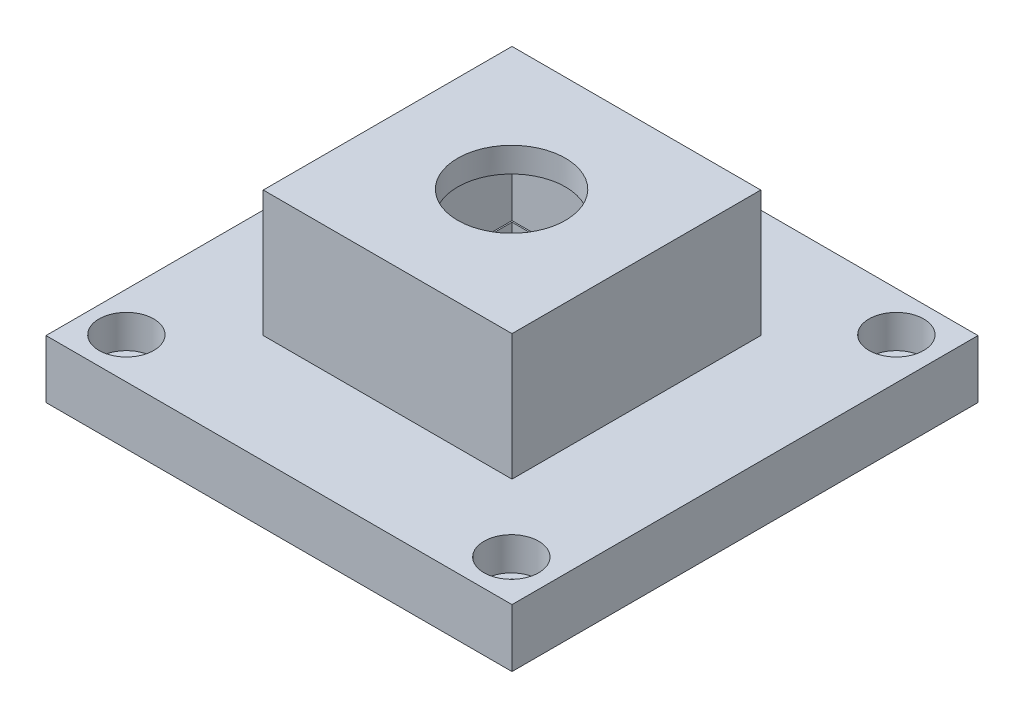
ISO-10303-21;
HEADER;
FILE_DESCRIPTION(('STEP AP214'),'2;1');
FILE_NAME('part.step','',(''),(''),'','','');
FILE_SCHEMA(('AUTOMOTIVE_DESIGN { 1 0 10303 214 1 1 1 1 }'));
ENDSEC;
DATA;
#1=APPLICATION_CONTEXT('core data for automotive mechanical design processes');
#2=APPLICATION_PROTOCOL_DEFINITION('international standard','automotive_design',2000,#1);
#3=PRODUCT_CONTEXT('',#1,'mechanical');
#4=PRODUCT('Part','Part','',(#3));
#5=PRODUCT_RELATED_PRODUCT_CATEGORY('part','',(#4));
#6=PRODUCT_DEFINITION_FORMATION('','',#4);
#7=PRODUCT_DEFINITION_CONTEXT('part definition',#1,'design');
#8=PRODUCT_DEFINITION('design','',#6,#7);
#9=PRODUCT_DEFINITION_SHAPE('','',#8);
#10=(LENGTH_UNIT() NAMED_UNIT(*) SI_UNIT(.MILLI.,.METRE.));
#11=(NAMED_UNIT(*) PLANE_ANGLE_UNIT() SI_UNIT($,.RADIAN.));
#12=(NAMED_UNIT(*) SI_UNIT($,.STERADIAN.) SOLID_ANGLE_UNIT());
#13=UNCERTAINTY_MEASURE_WITH_UNIT(LENGTH_MEASURE(1.E-05),#10,'distance_accuracy_value','');
#14=(GEOMETRIC_REPRESENTATION_CONTEXT(3) GLOBAL_UNCERTAINTY_ASSIGNED_CONTEXT((#13)) GLOBAL_UNIT_ASSIGNED_CONTEXT((#10,
#11,#12)) REPRESENTATION_CONTEXT('',''));
#15=CARTESIAN_POINT('',(0.,0.,0.));
#16=DIRECTION('',(0.,0.,1.));
#17=DIRECTION('',(1.,0.,0.));
#18=AXIS2_PLACEMENT_3D('',#15,#16,#17);
#19=CARTESIAN_POINT('',(-19.05,108.2548,0.));
#20=DIRECTION('',(-1.,0.,0.));
#21=DIRECTION('',(0.,0.,1.));
#22=AXIS2_PLACEMENT_3D('',#19,#20,#21);
#23=PLANE('',#22);
#24=DIRECTION('',(0.,0.,-1.));
#25=VECTOR('',#24,1.);
#26=CARTESIAN_POINT('',(-19.05,88.9508,0.));
#27=LINE('',#26,#25);
#28=CARTESIAN_POINT('',(-19.05,88.9508,19.05));
#29=VERTEX_POINT('',#28);
#30=CARTESIAN_POINT('',(-19.05,88.9508,-19.05));
#31=VERTEX_POINT('',#30);
#32=EDGE_CURVE('E135',#29,#31,#27,.T.);
#33=ORIENTED_EDGE('',*,*,#32,.F.);
#34=DIRECTION('',(0.,-1.,0.));
#35=VECTOR('',#34,1.);
#36=CARTESIAN_POINT('',(-19.05,108.2548,19.05));
#37=LINE('',#36,#35);
#38=CARTESIAN_POINT('',(-19.05,108.2548,19.05));
#39=VERTEX_POINT('',#38);
#40=EDGE_CURVE('E13',#39,#29,#37,.T.);
#41=ORIENTED_EDGE('',*,*,#40,.F.);
#42=DIRECTION('',(0.,0.,-1.));
#43=VECTOR('',#42,1.);
#44=CARTESIAN_POINT('',(-19.05,108.2548,0.));
#45=LINE('',#44,#43);
#46=CARTESIAN_POINT('',(-19.05,108.2548,-19.05));
#47=VERTEX_POINT('',#46);
#48=EDGE_CURVE('E166',#39,#47,#45,.T.);
#49=ORIENTED_EDGE('',*,*,#48,.T.);
#50=DIRECTION('',(0.,-1.,0.));
#51=VECTOR('',#50,1.);
#52=CARTESIAN_POINT('',(-19.05,108.2548,-19.05));
#53=LINE('',#52,#51);
#54=EDGE_CURVE('E101',#47,#31,#53,.T.);
#55=ORIENTED_EDGE('',*,*,#54,.T.);
#56=EDGE_LOOP('',(#33,#41,#49,#55));
#57=FACE_BOUND('',#56,.T.);
#58=ADVANCED_FACE('F52',(#57),#23,.T.);
#59=CARTESIAN_POINT('',(0.,108.2548,19.05));
#60=DIRECTION('',(0.,0.,1.));
#61=DIRECTION('',(1.,0.,0.));
#62=AXIS2_PLACEMENT_3D('',#59,#60,#61);
#63=PLANE('',#62);
#64=DIRECTION('',(-1.,0.,0.));
#65=VECTOR('',#64,1.);
#66=CARTESIAN_POINT('',(0.,88.9508,19.05));
#67=LINE('',#66,#65);
#68=CARTESIAN_POINT('',(19.05,88.9508,19.05));
#69=VERTEX_POINT('',#68);
#70=EDGE_CURVE('E169',#69,#29,#67,.T.);
#71=ORIENTED_EDGE('',*,*,#70,.F.);
#72=DIRECTION('',(0.,-1.,0.));
#73=VECTOR('',#72,1.);
#74=CARTESIAN_POINT('',(19.05,108.2548,19.05));
#75=LINE('',#74,#73);
#76=CARTESIAN_POINT('',(19.05,108.2548,19.05));
#77=VERTEX_POINT('',#76);
#78=EDGE_CURVE('E60',#77,#69,#75,.T.);
#79=ORIENTED_EDGE('',*,*,#78,.F.);
#80=DIRECTION('',(-1.,0.,0.));
#81=VECTOR('',#80,1.);
#82=CARTESIAN_POINT('',(0.,108.2548,19.05));
#83=LINE('',#82,#81);
#84=EDGE_CURVE('E174',#77,#39,#83,.T.);
#85=ORIENTED_EDGE('',*,*,#84,.T.);
#86=ORIENTED_EDGE('',*,*,#40,.T.);
#87=EDGE_LOOP('',(#71,#79,#85,#86));
#88=FACE_BOUND('',#87,.T.);
#89=ADVANCED_FACE('F192',(#88),#63,.T.);
#90=CARTESIAN_POINT('',(19.05,108.2548,0.));
#91=DIRECTION('',(1.,0.,0.));
#92=DIRECTION('',(0.,0.,-1.));
#93=AXIS2_PLACEMENT_3D('',#90,#91,#92);
#94=PLANE('',#93);
#95=DIRECTION('',(0.,0.,1.));
#96=VECTOR('',#95,1.);
#97=CARTESIAN_POINT('',(19.05,88.9508,0.));
#98=LINE('',#97,#96);
#99=CARTESIAN_POINT('',(19.05,88.9508,-19.05));
#100=VERTEX_POINT('',#99);
#101=EDGE_CURVE('E181',#100,#69,#98,.T.);
#102=ORIENTED_EDGE('',*,*,#101,.F.);
#103=DIRECTION('',(0.,-1.,0.));
#104=VECTOR('',#103,1.);
#105=CARTESIAN_POINT('',(19.05,108.2548,-19.05));
#106=LINE('',#105,#104);
#107=CARTESIAN_POINT('',(19.05,108.2548,-19.05));
#108=VERTEX_POINT('',#107);
#109=EDGE_CURVE('E187',#108,#100,#106,.T.);
#110=ORIENTED_EDGE('',*,*,#109,.F.);
#111=DIRECTION('',(0.,0.,1.));
#112=VECTOR('',#111,1.);
#113=CARTESIAN_POINT('',(19.05,108.2548,0.));
#114=LINE('',#113,#112);
#115=EDGE_CURVE('E171',#108,#77,#114,.T.);
#116=ORIENTED_EDGE('',*,*,#115,.T.);
#117=ORIENTED_EDGE('',*,*,#78,.T.);
#118=EDGE_LOOP('',(#102,#110,#116,#117));
#119=FACE_BOUND('',#118,.T.);
#120=ADVANCED_FACE('F196',(#119),#94,.T.);
#121=CARTESIAN_POINT('',(0.,108.2548,-19.05));
#122=DIRECTION('',(0.,0.,-1.));
#123=DIRECTION('',(-1.,0.,0.));
#124=AXIS2_PLACEMENT_3D('',#121,#122,#123);
#125=PLANE('',#124);
#126=DIRECTION('',(1.,0.,0.));
#127=VECTOR('',#126,1.);
#128=CARTESIAN_POINT('',(0.,88.9508,-19.05));
#129=LINE('',#128,#127);
#130=EDGE_CURVE('E178',#31,#100,#129,.T.);
#131=ORIENTED_EDGE('',*,*,#130,.F.);
#132=ORIENTED_EDGE('',*,*,#54,.F.);
#133=DIRECTION('',(1.,0.,0.));
#134=VECTOR('',#133,1.);
#135=CARTESIAN_POINT('',(0.,108.2548,-19.05));
#136=LINE('',#135,#134);
#137=EDGE_CURVE('E168',#47,#108,#136,.T.);
#138=ORIENTED_EDGE('',*,*,#137,.T.);
#139=ORIENTED_EDGE('',*,*,#109,.T.);
#140=EDGE_LOOP('',(#131,#132,#138,#139));
#141=FACE_BOUND('',#140,.T.);
#142=ADVANCED_FACE('F188',(#141),#125,.T.);
#143=CARTESIAN_POINT('',(0.,108.2548,0.));
#144=DIRECTION('',(0.,-1.,0.));
#145=DIRECTION('',(0.,0.,-1.));
#146=AXIS2_PLACEMENT_3D('',#143,#144,#145);
#147=PLANE('',#146);
#148=CARTESIAN_POINT('',(-0.128244477661507,108.2548,-0.0641222388311462));
#149=DIRECTION('',(0.,1.,0.));
#150=DIRECTION('',(0.,0.,1.));
#151=AXIS2_PLACEMENT_3D('',#148,#149,#150);
#152=CIRCLE('',#151,8.255);
#153=CARTESIAN_POINT('',(-0.128244477661507,108.2548,8.19087776116885));
#154=VERTEX_POINT('',#153);
#155=EDGE_CURVE('E296',#154,#154,#152,.T.);
#156=ORIENTED_EDGE('',*,*,#155,.F.);
#157=EDGE_LOOP('',(#156));
#158=FACE_BOUND('',#157,.T.);
#159=ORIENTED_EDGE('',*,*,#48,.F.);
#160=ORIENTED_EDGE('',*,*,#84,.F.);
#161=ORIENTED_EDGE('',*,*,#115,.F.);
#162=ORIENTED_EDGE('',*,*,#137,.F.);
#163=EDGE_LOOP('',(#159,#160,#161,#162));
#164=FACE_BOUND('',#163,.T.);
#165=ADVANCED_FACE('F198',(#158,#164),#147,.F.);
#166=CARTESIAN_POINT('',(0.,88.9508,0.));
#167=DIRECTION('',(0.,-1.,0.));
#168=DIRECTION('',(0.,0.,-1.));
#169=AXIS2_PLACEMENT_3D('',#166,#167,#168);
#170=PLANE('',#169);
#171=DIRECTION('',(0.,0.,-1.));
#172=VECTOR('',#171,1.);
#173=CARTESIAN_POINT('',(-15.24,88.9508,0.));
#174=LINE('',#173,#172);
#175=CARTESIAN_POINT('',(-15.24,88.9508,15.24));
#176=VERTEX_POINT('',#175);
#177=CARTESIAN_POINT('',(-15.24,88.9508,-15.24));
#178=VERTEX_POINT('',#177);
#179=EDGE_CURVE('E159',#176,#178,#174,.T.);
#180=ORIENTED_EDGE('',*,*,#179,.F.);
#181=DIRECTION('',(-1.,0.,0.));
#182=VECTOR('',#181,1.);
#183=CARTESIAN_POINT('',(0.,88.9508,15.24));
#184=LINE('',#183,#182);
#185=CARTESIAN_POINT('',(15.24,88.9508,15.24));
#186=VERTEX_POINT('',#185);
#187=EDGE_CURVE('E131',#186,#176,#184,.T.);
#188=ORIENTED_EDGE('',*,*,#187,.F.);
#189=DIRECTION('',(0.,0.,1.));
#190=VECTOR('',#189,1.);
#191=CARTESIAN_POINT('',(15.24,88.9508,0.));
#192=LINE('',#191,#190);
#193=CARTESIAN_POINT('',(15.24,88.9508,-15.24));
#194=VERTEX_POINT('',#193);
#195=EDGE_CURVE('E68',#194,#186,#192,.T.);
#196=ORIENTED_EDGE('',*,*,#195,.F.);
#197=DIRECTION('',(1.,0.,0.));
#198=VECTOR('',#197,1.);
#199=CARTESIAN_POINT('',(0.,88.9508,-15.24));
#200=LINE('',#199,#198);
#201=EDGE_CURVE('E161',#178,#194,#200,.T.);
#202=ORIENTED_EDGE('',*,*,#201,.F.);
#203=EDGE_LOOP('',(#180,#188,#196,#202));
#204=FACE_BOUND('',#203,.T.);
#205=ORIENTED_EDGE('',*,*,#32,.T.);
#206=ORIENTED_EDGE('',*,*,#130,.T.);
#207=ORIENTED_EDGE('',*,*,#101,.T.);
#208=ORIENTED_EDGE('',*,*,#70,.T.);
#209=EDGE_LOOP('',(#205,#206,#207,#208));
#210=FACE_BOUND('',#209,.T.);
#211=ADVANCED_FACE('F191',(#204,#210),#170,.T.);
#212=CARTESIAN_POINT('',(-15.24,108.2548,0.));
#213=DIRECTION('',(-1.,0.,0.));
#214=DIRECTION('',(0.,0.,1.));
#215=AXIS2_PLACEMENT_3D('',#212,#213,#214);
#216=PLANE('',#215);
#217=ORIENTED_EDGE('',*,*,#179,.T.);
#218=DIRECTION('',(0.,-1.,0.));
#219=VECTOR('',#218,1.);
#220=CARTESIAN_POINT('',(-15.24,108.2548,-15.24));
#221=LINE('',#220,#219);
#222=CARTESIAN_POINT('',(-15.24,104.4448,-15.24));
#223=VERTEX_POINT('',#222);
#224=EDGE_CURVE('E141',#223,#178,#221,.T.);
#225=ORIENTED_EDGE('',*,*,#224,.F.);
#226=DIRECTION('',(0.,0.,-1.));
#227=VECTOR('',#226,1.);
#228=CARTESIAN_POINT('',(-15.24,104.4448,0.));
#229=LINE('',#228,#227);
#230=CARTESIAN_POINT('',(-15.24,104.4448,15.24));
#231=VERTEX_POINT('',#230);
#232=EDGE_CURVE('E139',#231,#223,#229,.T.);
#233=ORIENTED_EDGE('',*,*,#232,.F.);
#234=DIRECTION('',(0.,-1.,0.));
#235=VECTOR('',#234,1.);
#236=CARTESIAN_POINT('',(-15.24,108.2548,15.24));
#237=LINE('',#236,#235);
#238=EDGE_CURVE('E125',#231,#176,#237,.T.);
#239=ORIENTED_EDGE('',*,*,#238,.T.);
#240=EDGE_LOOP('',(#217,#225,#233,#239));
#241=FACE_BOUND('',#240,.T.);
#242=ADVANCED_FACE('F140',(#241),#216,.F.);
#243=CARTESIAN_POINT('',(0.,108.2548,15.24));
#244=DIRECTION('',(0.,0.,1.));
#245=DIRECTION('',(1.,0.,0.));
#246=AXIS2_PLACEMENT_3D('',#243,#244,#245);
#247=PLANE('',#246);
#248=ORIENTED_EDGE('',*,*,#187,.T.);
#249=ORIENTED_EDGE('',*,*,#238,.F.);
#250=DIRECTION('',(-1.,0.,0.));
#251=VECTOR('',#250,1.);
#252=CARTESIAN_POINT('',(0.,104.4448,15.24));
#253=LINE('',#252,#251);
#254=CARTESIAN_POINT('',(15.24,104.4448,15.24));
#255=VERTEX_POINT('',#254);
#256=EDGE_CURVE('E129',#255,#231,#253,.T.);
#257=ORIENTED_EDGE('',*,*,#256,.F.);
#258=DIRECTION('',(0.,-1.,0.));
#259=VECTOR('',#258,1.);
#260=CARTESIAN_POINT('',(15.24,108.2548,15.24));
#261=LINE('',#260,#259);
#262=EDGE_CURVE('E136',#255,#186,#261,.T.);
#263=ORIENTED_EDGE('',*,*,#262,.T.);
#264=EDGE_LOOP('',(#248,#249,#257,#263));
#265=FACE_BOUND('',#264,.T.);
#266=ADVANCED_FACE('F127',(#265),#247,.F.);
#267=CARTESIAN_POINT('',(15.24,108.2548,0.));
#268=DIRECTION('',(1.,0.,0.));
#269=DIRECTION('',(0.,0.,-1.));
#270=AXIS2_PLACEMENT_3D('',#267,#268,#269);
#271=PLANE('',#270);
#272=ORIENTED_EDGE('',*,*,#195,.T.);
#273=ORIENTED_EDGE('',*,*,#262,.F.);
#274=DIRECTION('',(0.,0.,1.));
#275=VECTOR('',#274,1.);
#276=CARTESIAN_POINT('',(15.24,104.4448,0.));
#277=LINE('',#276,#275);
#278=CARTESIAN_POINT('',(15.24,104.4448,-15.24));
#279=VERTEX_POINT('',#278);
#280=EDGE_CURVE('E150',#279,#255,#277,.T.);
#281=ORIENTED_EDGE('',*,*,#280,.F.);
#282=DIRECTION('',(0.,-1.,0.));
#283=VECTOR('',#282,1.);
#284=CARTESIAN_POINT('',(15.24,108.2548,-15.24));
#285=LINE('',#284,#283);
#286=EDGE_CURVE('E152',#279,#194,#285,.T.);
#287=ORIENTED_EDGE('',*,*,#286,.T.);
#288=EDGE_LOOP('',(#272,#273,#281,#287));
#289=FACE_BOUND('',#288,.T.);
#290=ADVANCED_FACE('F249',(#289),#271,.F.);
#291=CARTESIAN_POINT('',(0.,108.2548,-15.24));
#292=DIRECTION('',(0.,0.,-1.));
#293=DIRECTION('',(-1.,0.,0.));
#294=AXIS2_PLACEMENT_3D('',#291,#292,#293);
#295=PLANE('',#294);
#296=ORIENTED_EDGE('',*,*,#201,.T.);
#297=ORIENTED_EDGE('',*,*,#286,.F.);
#298=DIRECTION('',(1.,0.,0.));
#299=VECTOR('',#298,1.);
#300=CARTESIAN_POINT('',(0.,104.4448,-15.24));
#301=LINE('',#300,#299);
#302=EDGE_CURVE('E145',#223,#279,#301,.T.);
#303=ORIENTED_EDGE('',*,*,#302,.F.);
#304=ORIENTED_EDGE('',*,*,#224,.T.);
#305=EDGE_LOOP('',(#296,#297,#303,#304));
#306=FACE_BOUND('',#305,.T.);
#307=ADVANCED_FACE('F258',(#306),#295,.F.);
#308=CARTESIAN_POINT('',(0.,104.4448,0.));
#309=DIRECTION('',(0.,-1.,0.));
#310=DIRECTION('',(0.,0.,-1.));
#311=AXIS2_PLACEMENT_3D('',#308,#309,#310);
#312=PLANE('',#311);
#313=CARTESIAN_POINT('',(-0.128244477661507,104.4448,-0.0641222388311462));
#314=DIRECTION('',(0.,-1.,0.));
#315=DIRECTION('',(0.,0.,-1.));
#316=AXIS2_PLACEMENT_3D('',#313,#314,#315);
#317=CIRCLE('',#316,8.255);
#318=CARTESIAN_POINT('',(-0.128244477661507,104.4448,-8.31912223883115));
#319=VERTEX_POINT('',#318);
#320=EDGE_CURVE('E55',#319,#319,#317,.T.);
#321=ORIENTED_EDGE('',*,*,#320,.F.);
#322=EDGE_LOOP('',(#321));
#323=FACE_BOUND('',#322,.T.);
#324=ORIENTED_EDGE('',*,*,#232,.T.);
#325=ORIENTED_EDGE('',*,*,#302,.T.);
#326=ORIENTED_EDGE('',*,*,#280,.T.);
#327=ORIENTED_EDGE('',*,*,#256,.T.);
#328=EDGE_LOOP('',(#324,#325,#326,#327));
#329=FACE_BOUND('',#328,.T.);
#330=ADVANCED_FACE('F148',(#323,#329),#312,.T.);
#331=CARTESIAN_POINT('',(-0.128244477661507,88.9508,-0.0641222388311462));
#332=DIRECTION('',(0.,1.,0.));
#333=DIRECTION('',(0.,0.,1.));
#334=AXIS2_PLACEMENT_3D('',#331,#332,#333);
#335=CYLINDRICAL_SURFACE('',#334,8.255);
#336=ORIENTED_EDGE('',*,*,#320,.T.);
#337=EDGE_LOOP('',(#336));
#338=FACE_BOUND('',#337,.T.);
#339=ORIENTED_EDGE('',*,*,#155,.T.);
#340=EDGE_LOOP('',(#339));
#341=FACE_BOUND('',#340,.T.);
#342=ADVANCED_FACE('F279',(#338,#341),#335,.F.);
#343=CLOSED_SHELL('',(#58,#89,#120,#142,#165,#211,#242,#266,#290,#307,#330,#342));
#344=MANIFOLD_SOLID_BREP('B2',#343);
#345=CARTESIAN_POINT('',(-29.4812110895342,80.0608,29.4812110895342));
#346=DIRECTION('',(0.,1.,0.));
#347=DIRECTION('',(0.,0.,1.));
#348=AXIS2_PLACEMENT_3D('',#345,#346,#347);
#349=CYLINDRICAL_SURFACE('',#348,3.175);
#350=CARTESIAN_POINT('',(-29.4812110895342,80.0608,29.4812110895342));
#351=DIRECTION('',(0.,1.,0.));
#352=DIRECTION('',(0.,0.,1.));
#353=AXIS2_PLACEMENT_3D('',#350,#351,#352);
#354=CIRCLE('',#353,3.175);
#355=CARTESIAN_POINT('',(-29.4812110895342,80.0608,32.6562110895342));
#356=VERTEX_POINT('',#355);
#357=EDGE_CURVE('E494',#356,#356,#354,.T.);
#358=ORIENTED_EDGE('',*,*,#357,.F.);
#359=EDGE_LOOP('',(#358));
#360=FACE_BOUND('',#359,.T.);
#361=CARTESIAN_POINT('',(-29.4812110895342,83.8708,29.4812110895342));
#362=DIRECTION('',(0.,1.,0.));
#363=DIRECTION('',(0.,0.,1.));
#364=AXIS2_PLACEMENT_3D('',#361,#362,#363);
#365=CIRCLE('',#364,3.175);
#366=CARTESIAN_POINT('',(-29.4812110895342,83.8708,32.6562110895342));
#367=VERTEX_POINT('',#366);
#368=EDGE_CURVE('E316',#367,#367,#365,.F.);
#369=ORIENTED_EDGE('',*,*,#368,.F.);
#370=EDGE_LOOP('',(#369));
#371=FACE_BOUND('',#370,.T.);
#372=ADVANCED_FACE('F312',(#360,#371),#349,.F.);
#373=CARTESIAN_POINT('',(29.4847950216924,80.0608,-29.4847950216924));
#374=DIRECTION('',(0.,1.,0.));
#375=DIRECTION('',(0.,0.,1.));
#376=AXIS2_PLACEMENT_3D('',#373,#374,#375);
#377=CYLINDRICAL_SURFACE('',#376,3.175);
#378=CARTESIAN_POINT('',(29.4847950216924,80.0608,-29.4847950216924));
#379=DIRECTION('',(0.,1.,0.));
#380=DIRECTION('',(0.,0.,1.));
#381=AXIS2_PLACEMENT_3D('',#378,#379,#380);
#382=CIRCLE('',#381,3.175);
#383=CARTESIAN_POINT('',(29.4847950216924,80.0608,-26.3097950216924));
#384=VERTEX_POINT('',#383);
#385=EDGE_CURVE('E490',#384,#384,#382,.T.);
#386=ORIENTED_EDGE('',*,*,#385,.F.);
#387=EDGE_LOOP('',(#386));
#388=FACE_BOUND('',#387,.T.);
#389=CARTESIAN_POINT('',(29.4847950216924,83.8708,-29.4847950216924));
#390=DIRECTION('',(0.,1.,0.));
#391=DIRECTION('',(0.,0.,1.));
#392=AXIS2_PLACEMENT_3D('',#389,#390,#391);
#393=CIRCLE('',#392,3.175);
#394=CARTESIAN_POINT('',(29.4847950216924,83.8708,-26.3097950216924));
#395=VERTEX_POINT('',#394);
#396=EDGE_CURVE('E472',#395,#395,#393,.F.);
#397=ORIENTED_EDGE('',*,*,#396,.F.);
#398=EDGE_LOOP('',(#397));
#399=FACE_BOUND('',#398,.T.);
#400=ADVANCED_FACE('F580',(#388,#399),#377,.F.);
#401=CARTESIAN_POINT('',(-29.4825135870935,80.0608,-29.4825135870935));
#402=DIRECTION('',(0.,1.,0.));
#403=DIRECTION('',(0.,0.,1.));
#404=AXIS2_PLACEMENT_3D('',#401,#402,#403);
#405=CYLINDRICAL_SURFACE('',#404,3.175);
#406=CARTESIAN_POINT('',(-29.4825135870935,80.0608,-29.4825135870935));
#407=DIRECTION('',(0.,1.,0.));
#408=DIRECTION('',(0.,0.,1.));
#409=AXIS2_PLACEMENT_3D('',#406,#407,#408);
#410=CIRCLE('',#409,3.175);
#411=CARTESIAN_POINT('',(-29.4825135870935,80.0608,-26.3075135870935));
#412=VERTEX_POINT('',#411);
#413=EDGE_CURVE('E484',#412,#412,#410,.T.);
#414=ORIENTED_EDGE('',*,*,#413,.F.);
#415=EDGE_LOOP('',(#414));
#416=FACE_BOUND('',#415,.T.);
#417=CARTESIAN_POINT('',(-29.4825135870935,83.8708,-29.4825135870935));
#418=DIRECTION('',(0.,1.,0.));
#419=DIRECTION('',(0.,0.,1.));
#420=AXIS2_PLACEMENT_3D('',#417,#418,#419);
#421=CIRCLE('',#420,3.175);
#422=CARTESIAN_POINT('',(-29.4825135870935,83.8708,-26.3075135870935));
#423=VERTEX_POINT('',#422);
#424=EDGE_CURVE('E468',#423,#423,#421,.F.);
#425=ORIENTED_EDGE('',*,*,#424,.F.);
#426=EDGE_LOOP('',(#425));
#427=FACE_BOUND('',#426,.T.);
#428=ADVANCED_FACE('F586',(#416,#427),#405,.F.);
#429=CARTESIAN_POINT('',(29.4847950216924,80.0608,29.4847950216924));
#430=DIRECTION('',(0.,1.,0.));
#431=DIRECTION('',(0.,0.,1.));
#432=AXIS2_PLACEMENT_3D('',#429,#430,#431);
#433=CYLINDRICAL_SURFACE('',#432,3.175);
#434=CARTESIAN_POINT('',(29.4847950216924,80.0608,29.4847950216924));
#435=DIRECTION('',(0.,1.,0.));
#436=DIRECTION('',(0.,0.,1.));
#437=AXIS2_PLACEMENT_3D('',#434,#435,#436);
#438=CIRCLE('',#437,3.175);
#439=CARTESIAN_POINT('',(29.4847950216924,80.0608,32.6597950216924));
#440=VERTEX_POINT('',#439);
#441=EDGE_CURVE('E479',#440,#440,#438,.T.);
#442=ORIENTED_EDGE('',*,*,#441,.F.);
#443=EDGE_LOOP('',(#442));
#444=FACE_BOUND('',#443,.T.);
#445=CARTESIAN_POINT('',(29.4847950216924,83.8708,29.4847950216924));
#446=DIRECTION('',(0.,1.,0.));
#447=DIRECTION('',(0.,0.,1.));
#448=AXIS2_PLACEMENT_3D('',#445,#446,#447);
#449=CIRCLE('',#448,3.175);
#450=CARTESIAN_POINT('',(29.4847950216924,83.8708,32.6597950216924));
#451=VERTEX_POINT('',#450);
#452=EDGE_CURVE('E464',#451,#451,#449,.F.);
#453=ORIENTED_EDGE('',*,*,#452,.F.);
#454=EDGE_LOOP('',(#453));
#455=FACE_BOUND('',#454,.T.);
#456=ADVANCED_FACE('F593',(#444,#455),#433,.F.);
#457=CARTESIAN_POINT('',(35.687,88.9508,-35.687));
#458=DIRECTION('',(-1.,0.,0.));
#459=DIRECTION('',(0.,0.,1.));
#460=AXIS2_PLACEMENT_3D('',#457,#458,#459);
#461=PLANE('',#460);
#462=DIRECTION('',(0.,0.,1.));
#463=VECTOR('',#462,1.);
#464=CARTESIAN_POINT('',(35.687,80.0608,-35.687));
#465=LINE('',#464,#463);
#466=CARTESIAN_POINT('',(35.687,80.0608,-35.687));
#467=VERTEX_POINT('',#466);
#468=CARTESIAN_POINT('',(35.687,80.0608,35.687));
#469=VERTEX_POINT('',#468);
#470=EDGE_CURVE('E434',#467,#469,#465,.T.);
#471=ORIENTED_EDGE('',*,*,#470,.F.);
#472=DIRECTION('',(0.,-1.,0.));
#473=VECTOR('',#472,1.);
#474=CARTESIAN_POINT('',(35.687,88.9508,-35.687));
#475=LINE('',#474,#473);
#476=CARTESIAN_POINT('',(35.687,88.9508,-35.687));
#477=VERTEX_POINT('',#476);
#478=EDGE_CURVE('E50',#477,#467,#475,.T.);
#479=ORIENTED_EDGE('',*,*,#478,.F.);
#480=DIRECTION('',(0.,0.,-1.));
#481=VECTOR('',#480,1.);
#482=CARTESIAN_POINT('',(35.687,88.9508,-35.687));
#483=LINE('',#482,#481);
#484=CARTESIAN_POINT('',(35.687,88.9508,35.687));
#485=VERTEX_POINT('',#484);
#486=EDGE_CURVE('E437',#485,#477,#483,.T.);
#487=ORIENTED_EDGE('',*,*,#486,.F.);
#488=DIRECTION('',(0.,-1.,0.));
#489=VECTOR('',#488,1.);
#490=CARTESIAN_POINT('',(35.687,88.9508,35.687));
#491=LINE('',#490,#489);
#492=EDGE_CURVE('E453',#485,#469,#491,.T.);
#493=ORIENTED_EDGE('',*,*,#492,.T.);
#494=EDGE_LOOP('',(#471,#479,#487,#493));
#495=FACE_BOUND('',#494,.T.);
#496=ADVANCED_FACE('F314',(#495),#461,.F.);
#497=CARTESIAN_POINT('',(-35.687,88.9508,-35.687));
#498=DIRECTION('',(0.,0.,1.));
#499=DIRECTION('',(1.,0.,0.));
#500=AXIS2_PLACEMENT_3D('',#497,#498,#499);
#501=PLANE('',#500);
#502=DIRECTION('',(1.,0.,0.));
#503=VECTOR('',#502,1.);
#504=CARTESIAN_POINT('',(-35.687,80.0608,-35.687));
#505=LINE('',#504,#503);
#506=CARTESIAN_POINT('',(-35.687,80.0608,-35.687));
#507=VERTEX_POINT('',#506);
#508=EDGE_CURVE('E427',#507,#467,#505,.T.);
#509=ORIENTED_EDGE('',*,*,#508,.F.);
#510=DIRECTION('',(0.,-1.,0.));
#511=VECTOR('',#510,1.);
#512=CARTESIAN_POINT('',(-35.687,88.9508,-35.687));
#513=LINE('',#512,#511);
#514=CARTESIAN_POINT('',(-35.687,88.9508,-35.687));
#515=VERTEX_POINT('',#514);
#516=EDGE_CURVE('E322',#515,#507,#513,.T.);
#517=ORIENTED_EDGE('',*,*,#516,.F.);
#518=DIRECTION('',(-1.,0.,0.));
#519=VECTOR('',#518,1.);
#520=CARTESIAN_POINT('',(-35.687,88.9508,-35.687));
#521=LINE('',#520,#519);
#522=EDGE_CURVE('E444',#477,#515,#521,.T.);
#523=ORIENTED_EDGE('',*,*,#522,.F.);
#524=ORIENTED_EDGE('',*,*,#478,.T.);
#525=EDGE_LOOP('',(#509,#517,#523,#524));
#526=FACE_BOUND('',#525,.T.);
#527=ADVANCED_FACE('F564',(#526),#501,.F.);
#528=CARTESIAN_POINT('',(-35.687,88.9508,-35.687));
#529=DIRECTION('',(1.,0.,0.));
#530=DIRECTION('',(0.,0.,-1.));
#531=AXIS2_PLACEMENT_3D('',#528,#529,#530);
#532=PLANE('',#531);
#533=DIRECTION('',(0.,0.,1.));
#534=VECTOR('',#533,1.);
#535=CARTESIAN_POINT('',(-35.687,80.0608,-35.687));
#536=LINE('',#535,#534);
#537=CARTESIAN_POINT('',(-35.687,80.0608,35.687));
#538=VERTEX_POINT('',#537);
#539=EDGE_CURVE('E430',#507,#538,#536,.T.);
#540=ORIENTED_EDGE('',*,*,#539,.T.);
#541=DIRECTION('',(0.,-1.,0.));
#542=VECTOR('',#541,1.);
#543=CARTESIAN_POINT('',(-35.687,88.9508,35.687));
#544=LINE('',#543,#542);
#545=CARTESIAN_POINT('',(-35.687,88.9508,35.687));
#546=VERTEX_POINT('',#545);
#547=EDGE_CURVE('E457',#546,#538,#544,.T.);
#548=ORIENTED_EDGE('',*,*,#547,.F.);
#549=DIRECTION('',(0.,0.,1.));
#550=VECTOR('',#549,1.);
#551=CARTESIAN_POINT('',(-35.687,88.9508,-35.687));
#552=LINE('',#551,#550);
#553=EDGE_CURVE('E447',#515,#546,#552,.T.);
#554=ORIENTED_EDGE('',*,*,#553,.F.);
#555=ORIENTED_EDGE('',*,*,#516,.T.);
#556=EDGE_LOOP('',(#540,#548,#554,#555));
#557=FACE_BOUND('',#556,.T.);
#558=ADVANCED_FACE('F568',(#557),#532,.F.);
#559=CARTESIAN_POINT('',(-35.687,88.9508,35.687));
#560=DIRECTION('',(0.,0.,-1.));
#561=DIRECTION('',(-1.,0.,0.));
#562=AXIS2_PLACEMENT_3D('',#559,#560,#561);
#563=PLANE('',#562);
#564=DIRECTION('',(1.,0.,0.));
#565=VECTOR('',#564,1.);
#566=CARTESIAN_POINT('',(-35.687,80.0608,35.687));
#567=LINE('',#566,#565);
#568=EDGE_CURVE('E426',#538,#469,#567,.T.);
#569=ORIENTED_EDGE('',*,*,#568,.T.);
#570=ORIENTED_EDGE('',*,*,#492,.F.);
#571=DIRECTION('',(1.,0.,0.));
#572=VECTOR('',#571,1.);
#573=CARTESIAN_POINT('',(-35.687,88.9508,35.687));
#574=LINE('',#573,#572);
#575=EDGE_CURVE('E450',#546,#485,#574,.T.);
#576=ORIENTED_EDGE('',*,*,#575,.F.);
#577=ORIENTED_EDGE('',*,*,#547,.T.);
#578=EDGE_LOOP('',(#569,#570,#576,#577));
#579=FACE_BOUND('',#578,.T.);
#580=ADVANCED_FACE('F547',(#579),#563,.F.);
#581=CARTESIAN_POINT('',(0.,88.9508,0.));
#582=DIRECTION('',(0.,1.,0.));
#583=DIRECTION('',(0.,0.,1.));
#584=AXIS2_PLACEMENT_3D('',#581,#582,#583);
#585=PLANE('',#584);
#586=CARTESIAN_POINT('',(29.322292144694,88.9508,29.4224751947066));
#587=DIRECTION('',(0.,1.,0.));
#588=DIRECTION('',(0.,0.,1.));
#589=AXIS2_PLACEMENT_3D('',#586,#587,#588);
#590=CIRCLE('',#589,4.191);
#591=CARTESIAN_POINT('',(29.322292144694,88.9508,33.6134751947066));
#592=VERTEX_POINT('',#591);
#593=EDGE_CURVE('E511',#592,#592,#590,.T.);
#594=ORIENTED_EDGE('',*,*,#593,.F.);
#595=EDGE_LOOP('',(#594));
#596=FACE_BOUND('',#595,.T.);
#597=CARTESIAN_POINT('',(-29.6450164640919,88.9508,-29.5448334140793));
#598=DIRECTION('',(0.,1.,0.));
#599=DIRECTION('',(0.,0.,1.));
#600=AXIS2_PLACEMENT_3D('',#597,#598,#599);
#601=CIRCLE('',#600,4.191);
#602=CARTESIAN_POINT('',(-29.6450164640919,88.9508,-25.3538334140793));
#603=VERTEX_POINT('',#602);
#604=EDGE_CURVE('E519',#603,#603,#601,.T.);
#605=ORIENTED_EDGE('',*,*,#604,.F.);
#606=EDGE_LOOP('',(#605));
#607=FACE_BOUND('',#606,.T.);
#608=CARTESIAN_POINT('',(29.322292144694,88.9508,-29.5471148486782));
#609=DIRECTION('',(0.,1.,0.));
#610=DIRECTION('',(0.,0.,1.));
#611=AXIS2_PLACEMENT_3D('',#608,#609,#610);
#612=CIRCLE('',#611,4.191);
#613=CARTESIAN_POINT('',(29.322292144694,88.9508,-25.3561148486782));
#614=VERTEX_POINT('',#613);
#615=EDGE_CURVE('E527',#614,#614,#612,.T.);
#616=ORIENTED_EDGE('',*,*,#615,.F.);
#617=EDGE_LOOP('',(#616));
#618=FACE_BOUND('',#617,.T.);
#619=CARTESIAN_POINT('',(-29.6437139665326,88.9508,29.4188912625483));
#620=DIRECTION('',(0.,1.,0.));
#621=DIRECTION('',(0.,0.,1.));
#622=AXIS2_PLACEMENT_3D('',#619,#620,#621);
#623=CIRCLE('',#622,4.191);
#624=CARTESIAN_POINT('',(-29.6437139665326,88.9508,33.6098912625484));
#625=VERTEX_POINT('',#624);
#626=EDGE_CURVE('E503',#625,#625,#623,.T.);
#627=ORIENTED_EDGE('',*,*,#626,.F.);
#628=EDGE_LOOP('',(#627));
#629=FACE_BOUND('',#628,.T.);
#630=DIRECTION('',(1.,0.,0.));
#631=VECTOR('',#630,1.);
#632=CARTESIAN_POINT('',(0.,88.9508,15.0366650058129));
#633=LINE('',#632,#631);
#634=CARTESIAN_POINT('',(-15.0366650058129,88.9508,15.0366650058129));
#635=VERTEX_POINT('',#634);
#636=CARTESIAN_POINT('',(15.1052757834077,88.9508,15.0366650058129));
#637=VERTEX_POINT('',#636);
#638=EDGE_CURVE('E423',#635,#637,#633,.T.);
#639=ORIENTED_EDGE('',*,*,#638,.F.);
#640=DIRECTION('',(0.,0.,1.));
#641=VECTOR('',#640,1.);
#642=CARTESIAN_POINT('',(-15.0366650058129,88.9508,0.));
#643=LINE('',#642,#641);
#644=CARTESIAN_POINT('',(-15.0366650058129,88.9508,-15.0366650058129));
#645=VERTEX_POINT('',#644);
#646=EDGE_CURVE('E411',#645,#635,#643,.T.);
#647=ORIENTED_EDGE('',*,*,#646,.F.);
#648=DIRECTION('',(-1.,0.,0.));
#649=VECTOR('',#648,1.);
#650=CARTESIAN_POINT('',(0.,88.9508,-15.0366650058129));
#651=LINE('',#650,#649);
#652=CARTESIAN_POINT('',(15.1052757834077,88.9508,-15.0366650058129));
#653=VERTEX_POINT('',#652);
#654=EDGE_CURVE('E386',#653,#645,#651,.T.);
#655=ORIENTED_EDGE('',*,*,#654,.F.);
#656=DIRECTION('',(0.,0.,-1.));
#657=VECTOR('',#656,1.);
#658=CARTESIAN_POINT('',(15.1052757834077,88.9508,0.));
#659=LINE('',#658,#657);
#660=EDGE_CURVE('E420',#637,#653,#659,.T.);
#661=ORIENTED_EDGE('',*,*,#660,.F.);
#662=EDGE_LOOP('',(#639,#647,#655,#661));
#663=FACE_BOUND('',#662,.T.);
#664=ORIENTED_EDGE('',*,*,#486,.T.);
#665=ORIENTED_EDGE('',*,*,#522,.T.);
#666=ORIENTED_EDGE('',*,*,#553,.T.);
#667=ORIENTED_EDGE('',*,*,#575,.T.);
#668=EDGE_LOOP('',(#664,#665,#666,#667));
#669=FACE_BOUND('',#668,.T.);
#670=ADVANCED_FACE('F544',(#596,#607,#618,#629,#663,#669),#585,.T.);
#671=CARTESIAN_POINT('',(-35.687,80.0608,-35.687));
#672=DIRECTION('',(0.,-1.,0.));
#673=DIRECTION('',(0.,0.,-1.));
#674=AXIS2_PLACEMENT_3D('',#671,#672,#673);
#675=PLANE('',#674);
#676=ORIENTED_EDGE('',*,*,#441,.T.);
#677=EDGE_LOOP('',(#676));
#678=FACE_BOUND('',#677,.T.);
#679=ORIENTED_EDGE('',*,*,#413,.T.);
#680=EDGE_LOOP('',(#679));
#681=FACE_BOUND('',#680,.T.);
#682=ORIENTED_EDGE('',*,*,#385,.T.);
#683=EDGE_LOOP('',(#682));
#684=FACE_BOUND('',#683,.T.);
#685=ORIENTED_EDGE('',*,*,#357,.T.);
#686=EDGE_LOOP('',(#685));
#687=FACE_BOUND('',#686,.T.);
#688=DIRECTION('',(-1.,0.,0.));
#689=VECTOR('',#688,1.);
#690=CARTESIAN_POINT('',(-15.0366650058129,80.0608,15.0366650058129));
#691=LINE('',#690,#689);
#692=CARTESIAN_POINT('',(15.1052757834077,80.0608,15.0366650058129));
#693=VERTEX_POINT('',#692);
#694=CARTESIAN_POINT('',(-15.0366650058129,80.0608,15.0366650058129));
#695=VERTEX_POINT('',#694);
#696=EDGE_CURVE('E338',#693,#695,#691,.T.);
#697=ORIENTED_EDGE('',*,*,#696,.F.);
#698=DIRECTION('',(0.,0.,1.));
#699=VECTOR('',#698,1.);
#700=CARTESIAN_POINT('',(15.1052757834077,80.0608,15.0366650058129));
#701=LINE('',#700,#699);
#702=CARTESIAN_POINT('',(15.1052757834077,80.0608,-15.0366650058129));
#703=VERTEX_POINT('',#702);
#704=EDGE_CURVE('E401',#703,#693,#701,.T.);
#705=ORIENTED_EDGE('',*,*,#704,.F.);
#706=DIRECTION('',(1.,0.,0.));
#707=VECTOR('',#706,1.);
#708=CARTESIAN_POINT('',(-15.0366650058129,80.0608,-15.0366650058129));
#709=LINE('',#708,#707);
#710=CARTESIAN_POINT('',(-15.0366650058129,80.0608,-15.0366650058129));
#711=VERTEX_POINT('',#710);
#712=EDGE_CURVE('E383',#711,#703,#709,.T.);
#713=ORIENTED_EDGE('',*,*,#712,.F.);
#714=DIRECTION('',(0.,0.,-1.));
#715=VECTOR('',#714,1.);
#716=CARTESIAN_POINT('',(-15.0366650058129,80.0608,15.0366650058129));
#717=LINE('',#716,#715);
#718=EDGE_CURVE('E393',#695,#711,#717,.T.);
#719=ORIENTED_EDGE('',*,*,#718,.F.);
#720=EDGE_LOOP('',(#697,#705,#713,#719));
#721=FACE_BOUND('',#720,.T.);
#722=ORIENTED_EDGE('',*,*,#568,.F.);
#723=ORIENTED_EDGE('',*,*,#539,.F.);
#724=ORIENTED_EDGE('',*,*,#508,.T.);
#725=ORIENTED_EDGE('',*,*,#470,.T.);
#726=EDGE_LOOP('',(#722,#723,#724,#725));
#727=FACE_BOUND('',#726,.T.);
#728=ADVANCED_FACE('F398',(#678,#681,#684,#687,#721,#727),#675,.T.);
#729=CARTESIAN_POINT('',(-15.0366650058129,99.3648,15.0366650058129));
#730=DIRECTION('',(0.,0.,1.));
#731=DIRECTION('',(1.,0.,0.));
#732=AXIS2_PLACEMENT_3D('',#729,#730,#731);
#733=PLANE('',#732);
#734=ORIENTED_EDGE('',*,*,#638,.T.);
#735=DIRECTION('',(0.,-1.,0.));
#736=VECTOR('',#735,1.);
#737=CARTESIAN_POINT('',(15.1052757834077,99.3648,15.0366650058129));
#738=LINE('',#737,#736);
#739=EDGE_CURVE('E408',#637,#693,#738,.T.);
#740=ORIENTED_EDGE('',*,*,#739,.T.);
#741=ORIENTED_EDGE('',*,*,#696,.T.);
#742=DIRECTION('',(0.,-1.,0.));
#743=VECTOR('',#742,1.);
#744=CARTESIAN_POINT('',(-15.0366650058129,99.3648,15.0366650058129));
#745=LINE('',#744,#743);
#746=EDGE_CURVE('E390',#635,#695,#745,.T.);
#747=ORIENTED_EDGE('',*,*,#746,.F.);
#748=EDGE_LOOP('',(#734,#740,#741,#747));
#749=FACE_BOUND('',#748,.T.);
#750=ADVANCED_FACE('F571',(#749),#733,.F.);
#751=CARTESIAN_POINT('',(15.1052757834077,99.3648,15.0366650058129));
#752=DIRECTION('',(1.,0.,0.));
#753=DIRECTION('',(0.,0.,-1.));
#754=AXIS2_PLACEMENT_3D('',#751,#752,#753);
#755=PLANE('',#754);
#756=ORIENTED_EDGE('',*,*,#660,.T.);
#757=DIRECTION('',(0.,-1.,0.));
#758=VECTOR('',#757,1.);
#759=CARTESIAN_POINT('',(15.1052757834077,99.3648,-15.0366650058129));
#760=LINE('',#759,#758);
#761=EDGE_CURVE('E389',#653,#703,#760,.T.);
#762=ORIENTED_EDGE('',*,*,#761,.T.);
#763=ORIENTED_EDGE('',*,*,#704,.T.);
#764=ORIENTED_EDGE('',*,*,#739,.F.);
#765=EDGE_LOOP('',(#756,#762,#763,#764));
#766=FACE_BOUND('',#765,.T.);
#767=ADVANCED_FACE('F576',(#766),#755,.F.);
#768=CARTESIAN_POINT('',(-15.0366650058129,99.3648,-15.0366650058129));
#769=DIRECTION('',(0.,0.,-1.));
#770=DIRECTION('',(-1.,0.,0.));
#771=AXIS2_PLACEMENT_3D('',#768,#769,#770);
#772=PLANE('',#771);
#773=ORIENTED_EDGE('',*,*,#654,.T.);
#774=DIRECTION('',(0.,-1.,0.));
#775=VECTOR('',#774,1.);
#776=CARTESIAN_POINT('',(-15.0366650058129,99.3648,-15.0366650058129));
#777=LINE('',#776,#775);
#778=EDGE_CURVE('E330',#645,#711,#777,.T.);
#779=ORIENTED_EDGE('',*,*,#778,.T.);
#780=ORIENTED_EDGE('',*,*,#712,.T.);
#781=ORIENTED_EDGE('',*,*,#761,.F.);
#782=EDGE_LOOP('',(#773,#779,#780,#781));
#783=FACE_BOUND('',#782,.T.);
#784=ADVANCED_FACE('F380',(#783),#772,.F.);
#785=CARTESIAN_POINT('',(-15.0366650058129,99.3648,15.0366650058129));
#786=DIRECTION('',(-1.,0.,0.));
#787=DIRECTION('',(0.,0.,1.));
#788=AXIS2_PLACEMENT_3D('',#785,#786,#787);
#789=PLANE('',#788);
#790=ORIENTED_EDGE('',*,*,#646,.T.);
#791=ORIENTED_EDGE('',*,*,#746,.T.);
#792=ORIENTED_EDGE('',*,*,#718,.T.);
#793=ORIENTED_EDGE('',*,*,#778,.F.);
#794=EDGE_LOOP('',(#790,#791,#792,#793));
#795=FACE_BOUND('',#794,.T.);
#796=ADVANCED_FACE('F394',(#795),#789,.F.);
#797=CARTESIAN_POINT('',(29.322292144694,83.8708,29.4224751947066));
#798=DIRECTION('',(0.,1.,0.));
#799=DIRECTION('',(0.,0.,1.));
#800=AXIS2_PLACEMENT_3D('',#797,#798,#799);
#801=PLANE('',#800);
#802=CARTESIAN_POINT('',(29.322292144694,83.8708,29.4224751947066));
#803=DIRECTION('',(0.,1.,0.));
#804=DIRECTION('',(0.,0.,1.));
#805=AXIS2_PLACEMENT_3D('',#802,#803,#804);
#806=CIRCLE('',#805,4.191);
#807=CARTESIAN_POINT('',(29.322292144694,83.8708,33.6134751947066));
#808=VERTEX_POINT('',#807);
#809=EDGE_CURVE('E515',#808,#808,#806,.T.);
#810=ORIENTED_EDGE('',*,*,#809,.T.);
#811=EDGE_LOOP('',(#810));
#812=FACE_BOUND('',#811,.T.);
#813=ORIENTED_EDGE('',*,*,#452,.T.);
#814=EDGE_LOOP('',(#813));
#815=FACE_BOUND('',#814,.T.);
#816=ADVANCED_FACE('F601',(#812,#815),#801,.T.);
#817=CARTESIAN_POINT('',(29.322292144694,83.8708,29.4224751947066));
#818=DIRECTION('',(0.,1.,0.));
#819=DIRECTION('',(0.,0.,1.));
#820=AXIS2_PLACEMENT_3D('',#817,#818,#819);
#821=CYLINDRICAL_SURFACE('',#820,4.191);
#822=ORIENTED_EDGE('',*,*,#809,.F.);
#823=EDGE_LOOP('',(#822));
#824=FACE_BOUND('',#823,.T.);
#825=ORIENTED_EDGE('',*,*,#593,.T.);
#826=EDGE_LOOP('',(#825));
#827=FACE_BOUND('',#826,.T.);
#828=ADVANCED_FACE('F605',(#824,#827),#821,.F.);
#829=CARTESIAN_POINT('',(-29.6450164640919,83.8708,-29.5448334140793));
#830=DIRECTION('',(0.,1.,0.));
#831=DIRECTION('',(0.,0.,1.));
#832=AXIS2_PLACEMENT_3D('',#829,#830,#831);
#833=PLANE('',#832);
#834=CARTESIAN_POINT('',(-29.6450164640919,83.8708,-29.5448334140793));
#835=DIRECTION('',(0.,1.,0.));
#836=DIRECTION('',(0.,0.,1.));
#837=AXIS2_PLACEMENT_3D('',#834,#835,#836);
#838=CIRCLE('',#837,4.191);
#839=CARTESIAN_POINT('',(-29.6450164640919,83.8708,-25.3538334140793));
#840=VERTEX_POINT('',#839);
#841=EDGE_CURVE('E523',#840,#840,#838,.T.);
#842=ORIENTED_EDGE('',*,*,#841,.T.);
#843=EDGE_LOOP('',(#842));
#844=FACE_BOUND('',#843,.T.);
#845=ORIENTED_EDGE('',*,*,#424,.T.);
#846=EDGE_LOOP('',(#845));
#847=FACE_BOUND('',#846,.T.);
#848=ADVANCED_FACE('F611',(#844,#847),#833,.T.);
#849=CARTESIAN_POINT('',(-29.6450164640919,83.8708,-29.5448334140793));
#850=DIRECTION('',(0.,1.,0.));
#851=DIRECTION('',(0.,0.,1.));
#852=AXIS2_PLACEMENT_3D('',#849,#850,#851);
#853=CYLINDRICAL_SURFACE('',#852,4.191);
#854=ORIENTED_EDGE('',*,*,#841,.F.);
#855=EDGE_LOOP('',(#854));
#856=FACE_BOUND('',#855,.T.);
#857=ORIENTED_EDGE('',*,*,#604,.T.);
#858=EDGE_LOOP('',(#857));
#859=FACE_BOUND('',#858,.T.);
#860=ADVANCED_FACE('F616',(#856,#859),#853,.F.);
#861=CARTESIAN_POINT('',(29.322292144694,83.8708,-29.5471148486782));
#862=DIRECTION('',(0.,1.,0.));
#863=DIRECTION('',(0.,0.,1.));
#864=AXIS2_PLACEMENT_3D('',#861,#862,#863);
#865=PLANE('',#864);
#866=CARTESIAN_POINT('',(29.322292144694,83.8708,-29.5471148486782));
#867=DIRECTION('',(0.,1.,0.));
#868=DIRECTION('',(0.,0.,1.));
#869=AXIS2_PLACEMENT_3D('',#866,#867,#868);
#870=CIRCLE('',#869,4.191);
#871=CARTESIAN_POINT('',(29.322292144694,83.8708,-25.3561148486782));
#872=VERTEX_POINT('',#871);
#873=EDGE_CURVE('E507',#872,#872,#870,.T.);
#874=ORIENTED_EDGE('',*,*,#873,.T.);
#875=EDGE_LOOP('',(#874));
#876=FACE_BOUND('',#875,.T.);
#877=ORIENTED_EDGE('',*,*,#396,.T.);
#878=EDGE_LOOP('',(#877));
#879=FACE_BOUND('',#878,.T.);
#880=ADVANCED_FACE('F535',(#876,#879),#865,.T.);
#881=CARTESIAN_POINT('',(29.322292144694,83.8708,-29.5471148486782));
#882=DIRECTION('',(0.,1.,0.));
#883=DIRECTION('',(0.,0.,1.));
#884=AXIS2_PLACEMENT_3D('',#881,#882,#883);
#885=CYLINDRICAL_SURFACE('',#884,4.191);
#886=ORIENTED_EDGE('',*,*,#873,.F.);
#887=EDGE_LOOP('',(#886));
#888=FACE_BOUND('',#887,.T.);
#889=ORIENTED_EDGE('',*,*,#615,.T.);
#890=EDGE_LOOP('',(#889));
#891=FACE_BOUND('',#890,.T.);
#892=ADVANCED_FACE('F537',(#888,#891),#885,.F.);
#893=CARTESIAN_POINT('',(-29.6437139665326,83.8708,29.4188912625483));
#894=DIRECTION('',(0.,1.,0.));
#895=DIRECTION('',(0.,0.,1.));
#896=AXIS2_PLACEMENT_3D('',#893,#894,#895);
#897=PLANE('',#896);
#898=CARTESIAN_POINT('',(-29.6437139665326,83.8708,29.4188912625483));
#899=DIRECTION('',(0.,1.,0.));
#900=DIRECTION('',(0.,0.,1.));
#901=AXIS2_PLACEMENT_3D('',#898,#899,#900);
#902=CIRCLE('',#901,4.191);
#903=CARTESIAN_POINT('',(-29.6437139665326,83.8708,33.6098912625484));
#904=VERTEX_POINT('',#903);
#905=EDGE_CURVE('E469',#904,#904,#902,.T.);
#906=ORIENTED_EDGE('',*,*,#905,.T.);
#907=EDGE_LOOP('',(#906));
#908=FACE_BOUND('',#907,.T.);
#909=ORIENTED_EDGE('',*,*,#368,.T.);
#910=EDGE_LOOP('',(#909));
#911=FACE_BOUND('',#910,.T.);
#912=ADVANCED_FACE('F540',(#908,#911),#897,.T.);
#913=CARTESIAN_POINT('',(-29.6437139665326,83.8708,29.4188912625483));
#914=DIRECTION('',(0.,1.,0.));
#915=DIRECTION('',(0.,0.,1.));
#916=AXIS2_PLACEMENT_3D('',#913,#914,#915);
#917=CYLINDRICAL_SURFACE('',#916,4.191);
#918=ORIENTED_EDGE('',*,*,#905,.F.);
#919=EDGE_LOOP('',(#918));
#920=FACE_BOUND('',#919,.T.);
#921=ORIENTED_EDGE('',*,*,#626,.T.);
#922=EDGE_LOOP('',(#921));
#923=FACE_BOUND('',#922,.T.);
#924=ADVANCED_FACE('F621',(#920,#923),#917,.F.);
#925=CLOSED_SHELL('',(#372,#400,#428,#456,#496,#527,#558,#580,#670,#728,#750,#767,#784,#796,
#816,#828,#848,#860,#880,#892,#912,#924));
#926=MANIFOLD_SOLID_BREP('B7',#925);
#927=ADVANCED_BREP_SHAPE_REPRESENTATION('',(#18,#344,#926),#14);
#928=SHAPE_DEFINITION_REPRESENTATION(#9,#927);
ENDSEC;
END-ISO-10303-21;
